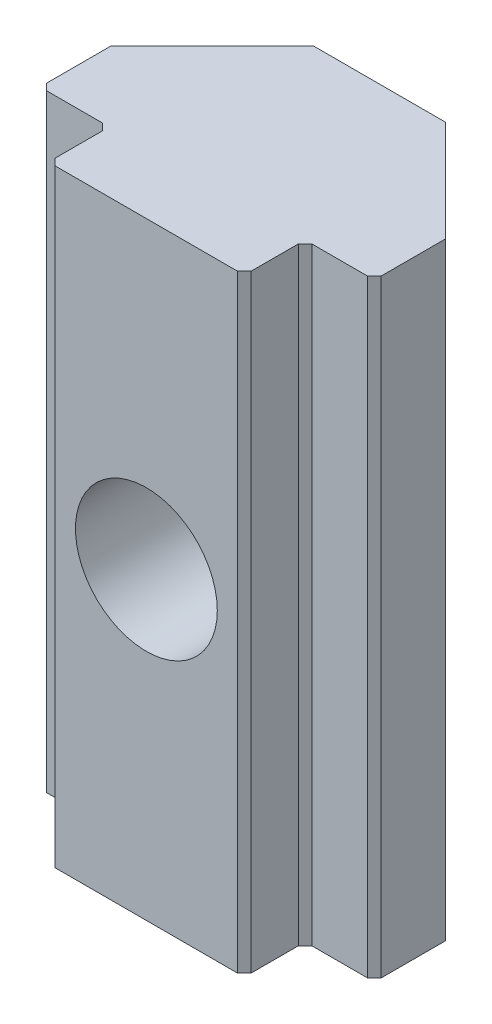
ISO-10303-21;
HEADER;
FILE_DESCRIPTION(('STEP AP214'),'2;1');
FILE_NAME('part.step','',(''),(''),'','','');
FILE_SCHEMA(('AUTOMOTIVE_DESIGN { 1 0 10303 214 1 1 1 1 }'));
ENDSEC;
DATA;
#1=APPLICATION_CONTEXT('core data for automotive mechanical design processes');
#2=APPLICATION_PROTOCOL_DEFINITION('international standard','automotive_design',2000,#1);
#3=PRODUCT_CONTEXT('',#1,'mechanical');
#4=PRODUCT('Part','Part','',(#3));
#5=PRODUCT_RELATED_PRODUCT_CATEGORY('part','',(#4));
#6=PRODUCT_DEFINITION_FORMATION('','',#4);
#7=PRODUCT_DEFINITION_CONTEXT('part definition',#1,'design');
#8=PRODUCT_DEFINITION('design','',#6,#7);
#9=PRODUCT_DEFINITION_SHAPE('','',#8);
#10=(LENGTH_UNIT() NAMED_UNIT(*) SI_UNIT(.MILLI.,.METRE.));
#11=(NAMED_UNIT(*) PLANE_ANGLE_UNIT() SI_UNIT($,.RADIAN.));
#12=(NAMED_UNIT(*) SI_UNIT($,.STERADIAN.) SOLID_ANGLE_UNIT());
#13=UNCERTAINTY_MEASURE_WITH_UNIT(LENGTH_MEASURE(1.E-05),#10,'distance_accuracy_value','');
#14=(GEOMETRIC_REPRESENTATION_CONTEXT(3) GLOBAL_UNCERTAINTY_ASSIGNED_CONTEXT((#13)) GLOBAL_UNIT_ASSIGNED_CONTEXT((#10,
#11,#12)) REPRESENTATION_CONTEXT('',''));
#15=CARTESIAN_POINT('',(0.,0.,0.));
#16=DIRECTION('',(0.,0.,1.));
#17=DIRECTION('',(1.,0.,0.));
#18=AXIS2_PLACEMENT_3D('',#15,#16,#17);
#19=CARTESIAN_POINT('',(-4.95,18.,-2.55));
#20=DIRECTION('',(0.,0.,1.));
#21=DIRECTION('',(1.,0.,0.));
#22=AXIS2_PLACEMENT_3D('',#19,#20,#21);
#23=PLANE('',#22);
#24=DIRECTION('',(0.,-1.,0.));
#25=VECTOR('',#24,1.);
#26=CARTESIAN_POINT('',(1.95,18.,-2.55));
#27=LINE('',#26,#25);
#28=CARTESIAN_POINT('',(1.95,18.,-2.55));
#29=VERTEX_POINT('',#28);
#30=CARTESIAN_POINT('',(1.95,9.77942286340599,-2.55));
#31=VERTEX_POINT('',#30);
#32=EDGE_CURVE('E186',#29,#31,#27,.T.);
#33=ORIENTED_EDGE('',*,*,#32,.T.);
#34=CARTESIAN_POINT('',(0.,9.,-2.55));
#35=DIRECTION('',(0.,0.,1.));
#36=DIRECTION('',(1.,0.,0.));
#37=AXIS2_PLACEMENT_3D('',#34,#35,#36);
#38=CIRCLE('',#37,2.1);
#39=CARTESIAN_POINT('',(-1.94999999999999,9.77942286340602,-2.55));
#40=VERTEX_POINT('',#39);
#41=EDGE_CURVE('E61',#31,#40,#38,.T.);
#42=ORIENTED_EDGE('',*,*,#41,.T.);
#43=DIRECTION('',(0.,1.,0.));
#44=VECTOR('',#43,1.);
#45=CARTESIAN_POINT('',(-1.94999999999999,18.,-2.55));
#46=LINE('',#45,#44);
#47=CARTESIAN_POINT('',(-1.94999999999999,18.,-2.55));
#48=VERTEX_POINT('',#47);
#49=EDGE_CURVE('E183',#40,#48,#46,.T.);
#50=ORIENTED_EDGE('',*,*,#49,.T.);
#51=DIRECTION('',(-1.,0.,0.));
#52=VECTOR('',#51,1.);
#53=CARTESIAN_POINT('',(-4.95,18.,-2.55));
#54=LINE('',#53,#52);
#55=EDGE_CURVE('E398',#29,#48,#54,.T.);
#56=ORIENTED_EDGE('',*,*,#55,.F.);
#57=EDGE_LOOP('',(#33,#42,#50,#56));
#58=FACE_BOUND('',#57,.T.);
#59=ADVANCED_FACE('F45',(#58),#23,.F.);
#60=CARTESIAN_POINT('',(4.95,18.,2.55));
#61=DIRECTION('',(-1.,0.,0.));
#62=DIRECTION('',(0.,0.,1.));
#63=AXIS2_PLACEMENT_3D('',#60,#61,#62);
#64=PLANE('',#63);
#65=DIRECTION('',(0.,0.,-1.));
#66=VECTOR('',#65,1.);
#67=CARTESIAN_POINT('',(4.95,18.,2.55));
#68=LINE('',#67,#66);
#69=CARTESIAN_POINT('',(4.95,18.,2.35));
#70=VERTEX_POINT('',#69);
#71=CARTESIAN_POINT('',(4.95,18.,0.450000000000006));
#72=VERTEX_POINT('',#71);
#73=EDGE_CURVE('E322',#70,#72,#68,.T.);
#74=ORIENTED_EDGE('',*,*,#73,.F.);
#75=DIRECTION('',(0.,-1.,0.));
#76=VECTOR('',#75,1.);
#77=CARTESIAN_POINT('',(4.95,18.,2.35));
#78=LINE('',#77,#76);
#79=CARTESIAN_POINT('',(4.95,0.,2.35));
#80=VERTEX_POINT('',#79);
#81=EDGE_CURVE('E252',#70,#80,#78,.T.);
#82=ORIENTED_EDGE('',*,*,#81,.T.);
#83=DIRECTION('',(0.,0.,-1.));
#84=VECTOR('',#83,1.);
#85=CARTESIAN_POINT('',(4.95,0.,2.55));
#86=LINE('',#85,#84);
#87=CARTESIAN_POINT('',(4.95,0.,0.450000000000006));
#88=VERTEX_POINT('',#87);
#89=EDGE_CURVE('E188',#80,#88,#86,.T.);
#90=ORIENTED_EDGE('',*,*,#89,.T.);
#91=DIRECTION('',(0.,1.,0.));
#92=VECTOR('',#91,1.);
#93=CARTESIAN_POINT('',(4.95,18.,0.450000000000006));
#94=LINE('',#93,#92);
#95=EDGE_CURVE('E208',#88,#72,#94,.T.);
#96=ORIENTED_EDGE('',*,*,#95,.T.);
#97=EDGE_LOOP('',(#74,#82,#90,#96));
#98=FACE_BOUND('',#97,.T.);
#99=ADVANCED_FACE('F419',(#98),#64,.F.);
#100=CARTESIAN_POINT('',(-1.94999999999999,0.,-2.55));
#101=VERTEX_POINT('',#100);
#102=CARTESIAN_POINT('',(-1.94999999999999,8.22057713659398,-2.55));
#103=VERTEX_POINT('',#102);
#104=EDGE_CURVE('E195',#101,#103,#46,.T.);
#105=ORIENTED_EDGE('',*,*,#104,.T.);
#106=CARTESIAN_POINT('',(1.95,8.22057713659401,-2.55));
#107=VERTEX_POINT('',#106);
#108=EDGE_CURVE('E173',#103,#107,#38,.T.);
#109=ORIENTED_EDGE('',*,*,#108,.T.);
#110=CARTESIAN_POINT('',(1.95,0.,-2.55));
#111=VERTEX_POINT('',#110);
#112=EDGE_CURVE('E200',#107,#111,#27,.T.);
#113=ORIENTED_EDGE('',*,*,#112,.T.);
#114=DIRECTION('',(-1.,0.,0.));
#115=VECTOR('',#114,1.);
#116=CARTESIAN_POINT('',(-4.95,0.,-2.55));
#117=LINE('',#116,#115);
#118=EDGE_CURVE('E345',#111,#101,#117,.T.);
#119=ORIENTED_EDGE('',*,*,#118,.T.);
#120=EDGE_LOOP('',(#105,#109,#113,#119));
#121=FACE_BOUND('',#120,.T.);
#122=ADVANCED_FACE('F344',(#121),#23,.F.);
#123=CARTESIAN_POINT('',(-4.95,18.,2.55));
#124=DIRECTION('',(1.,0.,0.));
#125=DIRECTION('',(0.,0.,-1.));
#126=AXIS2_PLACEMENT_3D('',#123,#124,#125);
#127=PLANE('',#126);
#128=DIRECTION('',(0.,0.,1.));
#129=VECTOR('',#128,1.);
#130=CARTESIAN_POINT('',(-4.95,0.,2.55));
#131=LINE('',#130,#129);
#132=CARTESIAN_POINT('',(-4.95,0.,0.45));
#133=VERTEX_POINT('',#132);
#134=CARTESIAN_POINT('',(-4.95,0.,2.34999999999999));
#135=VERTEX_POINT('',#134);
#136=EDGE_CURVE('E352',#133,#135,#131,.T.);
#137=ORIENTED_EDGE('',*,*,#136,.T.);
#138=DIRECTION('',(0.,1.,0.));
#139=VECTOR('',#138,1.);
#140=CARTESIAN_POINT('',(-4.95,18.,2.34999999999999));
#141=LINE('',#140,#139);
#142=CARTESIAN_POINT('',(-4.95,18.,2.34999999999999));
#143=VERTEX_POINT('',#142);
#144=EDGE_CURVE('E238',#135,#143,#141,.T.);
#145=ORIENTED_EDGE('',*,*,#144,.T.);
#146=DIRECTION('',(0.,0.,1.));
#147=VECTOR('',#146,1.);
#148=CARTESIAN_POINT('',(-4.95,18.,2.55));
#149=LINE('',#148,#147);
#150=CARTESIAN_POINT('',(-4.95,18.,0.45));
#151=VERTEX_POINT('',#150);
#152=EDGE_CURVE('E395',#151,#143,#149,.T.);
#153=ORIENTED_EDGE('',*,*,#152,.F.);
#154=DIRECTION('',(0.,-1.,0.));
#155=VECTOR('',#154,1.);
#156=CARTESIAN_POINT('',(-4.95,18.,0.45));
#157=LINE('',#156,#155);
#158=EDGE_CURVE('E304',#151,#133,#157,.T.);
#159=ORIENTED_EDGE('',*,*,#158,.T.);
#160=EDGE_LOOP('',(#137,#145,#153,#159));
#161=FACE_BOUND('',#160,.T.);
#162=ADVANCED_FACE('F428',(#161),#127,.F.);
#163=CARTESIAN_POINT('',(-4.95,18.,2.55));
#164=DIRECTION('',(0.,0.,-1.));
#165=DIRECTION('',(-1.,0.,0.));
#166=AXIS2_PLACEMENT_3D('',#163,#164,#165);
#167=PLANE('',#166);
#168=DIRECTION('',(1.,0.,0.));
#169=VECTOR('',#168,1.);
#170=CARTESIAN_POINT('',(-4.95,0.,2.55));
#171=LINE('',#170,#169);
#172=CARTESIAN_POINT('',(-4.75,0.,2.55));
#173=VERTEX_POINT('',#172);
#174=CARTESIAN_POINT('',(-3.1,0.,2.55));
#175=VERTEX_POINT('',#174);
#176=EDGE_CURVE('E357',#173,#175,#171,.T.);
#177=ORIENTED_EDGE('',*,*,#176,.T.);
#178=DIRECTION('',(0.,1.,0.));
#179=VECTOR('',#178,1.);
#180=CARTESIAN_POINT('',(-3.1,18.,2.55));
#181=LINE('',#180,#179);
#182=CARTESIAN_POINT('',(-3.1,18.,2.55));
#183=VERTEX_POINT('',#182);
#184=EDGE_CURVE('E223',#175,#183,#181,.T.);
#185=ORIENTED_EDGE('',*,*,#184,.T.);
#186=DIRECTION('',(1.,0.,0.));
#187=VECTOR('',#186,1.);
#188=CARTESIAN_POINT('',(-4.95,18.,2.55));
#189=LINE('',#188,#187);
#190=CARTESIAN_POINT('',(-4.75,18.,2.55));
#191=VERTEX_POINT('',#190);
#192=EDGE_CURVE('E389',#191,#183,#189,.T.);
#193=ORIENTED_EDGE('',*,*,#192,.F.);
#194=DIRECTION('',(0.,-1.,0.));
#195=VECTOR('',#194,1.);
#196=CARTESIAN_POINT('',(-4.75,18.,2.55));
#197=LINE('',#196,#195);
#198=EDGE_CURVE('E219',#191,#173,#197,.T.);
#199=ORIENTED_EDGE('',*,*,#198,.T.);
#200=EDGE_LOOP('',(#177,#185,#193,#199));
#201=FACE_BOUND('',#200,.T.);
#202=ADVANCED_FACE('F416',(#201),#167,.F.);
#203=CARTESIAN_POINT('',(-2.9,18.,4.35));
#204=DIRECTION('',(1.,0.,0.));
#205=DIRECTION('',(0.,0.,-1.));
#206=AXIS2_PLACEMENT_3D('',#203,#204,#205);
#207=PLANE('',#206);
#208=DIRECTION('',(0.,0.,1.));
#209=VECTOR('',#208,1.);
#210=CARTESIAN_POINT('',(-2.9,18.,4.35));
#211=LINE('',#210,#209);
#212=CARTESIAN_POINT('',(-2.9,18.,2.75));
#213=VERTEX_POINT('',#212);
#214=CARTESIAN_POINT('',(-2.9,18.,4.15));
#215=VERTEX_POINT('',#214);
#216=EDGE_CURVE('E379',#213,#215,#211,.T.);
#217=ORIENTED_EDGE('',*,*,#216,.F.);
#218=DIRECTION('',(0.,-1.,0.));
#219=VECTOR('',#218,1.);
#220=CARTESIAN_POINT('',(-2.9,0.,2.75));
#221=LINE('',#220,#219);
#222=CARTESIAN_POINT('',(-2.9,0.,2.75));
#223=VERTEX_POINT('',#222);
#224=EDGE_CURVE('E215',#213,#223,#221,.T.);
#225=ORIENTED_EDGE('',*,*,#224,.T.);
#226=DIRECTION('',(0.,0.,1.));
#227=VECTOR('',#226,1.);
#228=CARTESIAN_POINT('',(-2.9,0.,4.35));
#229=LINE('',#228,#227);
#230=CARTESIAN_POINT('',(-2.9,0.,4.15));
#231=VERTEX_POINT('',#230);
#232=EDGE_CURVE('E325',#223,#231,#229,.T.);
#233=ORIENTED_EDGE('',*,*,#232,.T.);
#234=DIRECTION('',(0.,1.,0.));
#235=VECTOR('',#234,1.);
#236=CARTESIAN_POINT('',(-2.9,18.,4.15));
#237=LINE('',#236,#235);
#238=EDGE_CURVE('E212',#231,#215,#237,.T.);
#239=ORIENTED_EDGE('',*,*,#238,.T.);
#240=EDGE_LOOP('',(#217,#225,#233,#239));
#241=FACE_BOUND('',#240,.T.);
#242=ADVANCED_FACE('F369',(#241),#207,.F.);
#243=CARTESIAN_POINT('',(-2.9,18.,4.35));
#244=DIRECTION('',(0.,0.,-1.));
#245=DIRECTION('',(-1.,0.,0.));
#246=AXIS2_PLACEMENT_3D('',#243,#244,#245);
#247=PLANE('',#246);
#248=CARTESIAN_POINT('',(0.,9.,4.35));
#249=DIRECTION('',(0.,0.,1.));
#250=DIRECTION('',(1.,0.,0.));
#251=AXIS2_PLACEMENT_3D('',#248,#249,#250);
#252=CIRCLE('',#251,2.1);
#253=CARTESIAN_POINT('',(2.1,9.,4.35));
#254=VERTEX_POINT('',#253);
#255=EDGE_CURVE('E403',#254,#254,#252,.T.);
#256=ORIENTED_EDGE('',*,*,#255,.F.);
#257=EDGE_LOOP('',(#256));
#258=FACE_BOUND('',#257,.T.);
#259=DIRECTION('',(1.,0.,0.));
#260=VECTOR('',#259,1.);
#261=CARTESIAN_POINT('',(-2.9,0.,4.35));
#262=LINE('',#261,#260);
#263=CARTESIAN_POINT('',(-2.7,0.,4.35));
#264=VERTEX_POINT('',#263);
#265=CARTESIAN_POINT('',(2.7,0.,4.35));
#266=VERTEX_POINT('',#265);
#267=EDGE_CURVE('E318',#264,#266,#262,.T.);
#268=ORIENTED_EDGE('',*,*,#267,.T.);
#269=DIRECTION('',(0.,1.,0.));
#270=VECTOR('',#269,1.);
#271=CARTESIAN_POINT('',(2.7,18.,4.35));
#272=LINE('',#271,#270);
#273=CARTESIAN_POINT('',(2.7,18.,4.35));
#274=VERTEX_POINT('',#273);
#275=EDGE_CURVE('E274',#266,#274,#272,.T.);
#276=ORIENTED_EDGE('',*,*,#275,.T.);
#277=DIRECTION('',(1.,0.,0.));
#278=VECTOR('',#277,1.);
#279=CARTESIAN_POINT('',(-2.9,18.,4.35));
#280=LINE('',#279,#278);
#281=CARTESIAN_POINT('',(-2.7,18.,4.35));
#282=VERTEX_POINT('',#281);
#283=EDGE_CURVE('E377',#282,#274,#280,.T.);
#284=ORIENTED_EDGE('',*,*,#283,.F.);
#285=DIRECTION('',(0.,-1.,0.));
#286=VECTOR('',#285,1.);
#287=CARTESIAN_POINT('',(-2.7,18.,4.35));
#288=LINE('',#287,#286);
#289=EDGE_CURVE('E270',#282,#264,#288,.T.);
#290=ORIENTED_EDGE('',*,*,#289,.T.);
#291=EDGE_LOOP('',(#268,#276,#284,#290));
#292=FACE_BOUND('',#291,.T.);
#293=ADVANCED_FACE('F381',(#258,#292),#247,.F.);
#294=CARTESIAN_POINT('',(2.9,18.,4.35));
#295=DIRECTION('',(-1.,0.,0.));
#296=DIRECTION('',(0.,0.,1.));
#297=AXIS2_PLACEMENT_3D('',#294,#295,#296);
#298=PLANE('',#297);
#299=DIRECTION('',(0.,0.,-1.));
#300=VECTOR('',#299,1.);
#301=CARTESIAN_POINT('',(2.9,0.,4.35));
#302=LINE('',#301,#300);
#303=CARTESIAN_POINT('',(2.9,0.,4.15));
#304=VERTEX_POINT('',#303);
#305=CARTESIAN_POINT('',(2.9,0.,2.75));
#306=VERTEX_POINT('',#305);
#307=EDGE_CURVE('E312',#304,#306,#302,.T.);
#308=ORIENTED_EDGE('',*,*,#307,.T.);
#309=DIRECTION('',(0.,1.,0.));
#310=VECTOR('',#309,1.);
#311=CARTESIAN_POINT('',(2.9,18.,2.75));
#312=LINE('',#311,#310);
#313=CARTESIAN_POINT('',(2.9,18.,2.75));
#314=VERTEX_POINT('',#313);
#315=EDGE_CURVE('E267',#306,#314,#312,.T.);
#316=ORIENTED_EDGE('',*,*,#315,.T.);
#317=DIRECTION('',(0.,0.,-1.));
#318=VECTOR('',#317,1.);
#319=CARTESIAN_POINT('',(2.9,18.,4.35));
#320=LINE('',#319,#318);
#321=CARTESIAN_POINT('',(2.9,18.,4.15));
#322=VERTEX_POINT('',#321);
#323=EDGE_CURVE('E294',#322,#314,#320,.T.);
#324=ORIENTED_EDGE('',*,*,#323,.F.);
#325=DIRECTION('',(0.,-1.,0.));
#326=VECTOR('',#325,1.);
#327=CARTESIAN_POINT('',(2.9,18.,4.15));
#328=LINE('',#327,#326);
#329=EDGE_CURVE('E263',#322,#304,#328,.T.);
#330=ORIENTED_EDGE('',*,*,#329,.T.);
#331=EDGE_LOOP('',(#308,#316,#324,#330));
#332=FACE_BOUND('',#331,.T.);
#333=ADVANCED_FACE('F315',(#332),#298,.F.);
#334=CARTESIAN_POINT('',(2.9,18.,2.55));
#335=DIRECTION('',(0.,0.,-1.));
#336=DIRECTION('',(-1.,0.,0.));
#337=AXIS2_PLACEMENT_3D('',#334,#335,#336);
#338=PLANE('',#337);
#339=DIRECTION('',(1.,0.,0.));
#340=VECTOR('',#339,1.);
#341=CARTESIAN_POINT('',(2.9,0.,2.55));
#342=LINE('',#341,#340);
#343=CARTESIAN_POINT('',(3.1,0.,2.55));
#344=VERTEX_POINT('',#343);
#345=CARTESIAN_POINT('',(4.75,0.,2.55));
#346=VERTEX_POINT('',#345);
#347=EDGE_CURVE('E313',#344,#346,#342,.T.);
#348=ORIENTED_EDGE('',*,*,#347,.T.);
#349=DIRECTION('',(0.,1.,0.));
#350=VECTOR('',#349,1.);
#351=CARTESIAN_POINT('',(4.75,18.,2.55));
#352=LINE('',#351,#350);
#353=CARTESIAN_POINT('',(4.75,18.,2.55));
#354=VERTEX_POINT('',#353);
#355=EDGE_CURVE('E260',#346,#354,#352,.T.);
#356=ORIENTED_EDGE('',*,*,#355,.T.);
#357=DIRECTION('',(1.,0.,0.));
#358=VECTOR('',#357,1.);
#359=CARTESIAN_POINT('',(2.9,18.,2.55));
#360=LINE('',#359,#358);
#361=CARTESIAN_POINT('',(3.1,18.,2.55));
#362=VERTEX_POINT('',#361);
#363=EDGE_CURVE('E292',#362,#354,#360,.T.);
#364=ORIENTED_EDGE('',*,*,#363,.F.);
#365=DIRECTION('',(0.,-1.,0.));
#366=VECTOR('',#365,1.);
#367=CARTESIAN_POINT('',(3.1,0.,2.55));
#368=LINE('',#367,#366);
#369=EDGE_CURVE('E256',#362,#344,#368,.T.);
#370=ORIENTED_EDGE('',*,*,#369,.T.);
#371=EDGE_LOOP('',(#348,#356,#364,#370));
#372=FACE_BOUND('',#371,.T.);
#373=ADVANCED_FACE('F300',(#372),#338,.F.);
#374=CARTESIAN_POINT('',(0.,18.,0.));
#375=DIRECTION('',(0.,-1.,0.));
#376=DIRECTION('',(0.,0.,-1.));
#377=AXIS2_PLACEMENT_3D('',#374,#375,#376);
#378=PLANE('',#377);
#379=ORIENTED_EDGE('',*,*,#152,.T.);
#380=DIRECTION('',(-0.707106781186544,0.,-0.707106781186551));
#381=VECTOR('',#380,1.);
#382=CARTESIAN_POINT('',(-4.75,18.,2.55));
#383=LINE('',#382,#381);
#384=EDGE_CURVE('E249',#143,#191,#383,.F.);
#385=ORIENTED_EDGE('',*,*,#384,.T.);
#386=ORIENTED_EDGE('',*,*,#192,.T.);
#387=DIRECTION('',(-0.707106781186544,0.,-0.707106781186551));
#388=VECTOR('',#387,1.);
#389=CARTESIAN_POINT('',(-2.82500000000001,18.,2.82499999999999));
#390=LINE('',#389,#388);
#391=EDGE_CURVE('E280',#183,#213,#390,.F.);
#392=ORIENTED_EDGE('',*,*,#391,.T.);
#393=ORIENTED_EDGE('',*,*,#216,.T.);
#394=DIRECTION('',(-0.707106781186548,0.,-0.707106781186548));
#395=VECTOR('',#394,1.);
#396=CARTESIAN_POINT('',(-2.7,18.,4.35));
#397=LINE('',#396,#395);
#398=EDGE_CURVE('E241',#215,#282,#397,.F.);
#399=ORIENTED_EDGE('',*,*,#398,.T.);
#400=ORIENTED_EDGE('',*,*,#283,.T.);
#401=DIRECTION('',(-0.707106781186551,0.,0.707106781186544));
#402=VECTOR('',#401,1.);
#403=CARTESIAN_POINT('',(2.9,18.,4.15));
#404=LINE('',#403,#402);
#405=EDGE_CURVE('E244',#274,#322,#404,.F.);
#406=ORIENTED_EDGE('',*,*,#405,.T.);
#407=ORIENTED_EDGE('',*,*,#323,.T.);
#408=DIRECTION('',(-0.707106781186551,0.,0.707106781186544));
#409=VECTOR('',#408,1.);
#410=CARTESIAN_POINT('',(2.82499999999999,18.,2.82500000000001));
#411=LINE('',#410,#409);
#412=EDGE_CURVE('E179',#314,#362,#411,.F.);
#413=ORIENTED_EDGE('',*,*,#412,.T.);
#414=ORIENTED_EDGE('',*,*,#363,.T.);
#415=DIRECTION('',(-0.707106781186548,0.,0.707106781186548));
#416=VECTOR('',#415,1.);
#417=CARTESIAN_POINT('',(4.95,18.,2.35));
#418=LINE('',#417,#416);
#419=EDGE_CURVE('E69',#354,#70,#418,.F.);
#420=ORIENTED_EDGE('',*,*,#419,.T.);
#421=ORIENTED_EDGE('',*,*,#73,.T.);
#422=DIRECTION('',(0.707106781186546,0.,0.707106781186549));
#423=VECTOR('',#422,1.);
#424=CARTESIAN_POINT('',(1.95,18.,-2.55));
#425=LINE('',#424,#423);
#426=EDGE_CURVE('E199',#72,#29,#425,.F.);
#427=ORIENTED_EDGE('',*,*,#426,.T.);
#428=ORIENTED_EDGE('',*,*,#55,.T.);
#429=DIRECTION('',(0.707106781186549,0.,-0.707106781186546));
#430=VECTOR('',#429,1.);
#431=CARTESIAN_POINT('',(-4.95,18.,0.45));
#432=LINE('',#431,#430);
#433=EDGE_CURVE('E193',#48,#151,#432,.F.);
#434=ORIENTED_EDGE('',*,*,#433,.T.);
#435=EDGE_LOOP('',(#379,#385,#386,#392,#393,#399,#400,#406,#407,#413,#414,#420,#421,#427,#428,#434));
#436=FACE_BOUND('',#435,.T.);
#437=ADVANCED_FACE('F291',(#436),#378,.F.);
#438=CARTESIAN_POINT('',(0.,0.,0.));
#439=DIRECTION('',(0.,-1.,0.));
#440=DIRECTION('',(0.,0.,-1.));
#441=AXIS2_PLACEMENT_3D('',#438,#439,#440);
#442=PLANE('',#441);
#443=ORIENTED_EDGE('',*,*,#176,.F.);
#444=DIRECTION('',(0.707106781186544,0.,0.707106781186551));
#445=VECTOR('',#444,1.);
#446=CARTESIAN_POINT('',(-3.65000000000002,0.,3.64999999999999));
#447=LINE('',#446,#445);
#448=EDGE_CURVE('E235',#173,#135,#447,.F.);
#449=ORIENTED_EDGE('',*,*,#448,.T.);
#450=ORIENTED_EDGE('',*,*,#136,.F.);
#451=DIRECTION('',(-0.707106781186549,0.,0.707106781186546));
#452=VECTOR('',#451,1.);
#453=CARTESIAN_POINT('',(-2.24999999999999,0.,-2.25));
#454=LINE('',#453,#452);
#455=EDGE_CURVE('E335',#133,#101,#454,.F.);
#456=ORIENTED_EDGE('',*,*,#455,.T.);
#457=ORIENTED_EDGE('',*,*,#118,.F.);
#458=DIRECTION('',(-0.707106781186546,0.,-0.707106781186549));
#459=VECTOR('',#458,1.);
#460=CARTESIAN_POINT('',(2.25000000000001,0.,-2.25));
#461=LINE('',#460,#459);
#462=EDGE_CURVE('E332',#111,#88,#461,.F.);
#463=ORIENTED_EDGE('',*,*,#462,.T.);
#464=ORIENTED_EDGE('',*,*,#89,.F.);
#465=DIRECTION('',(0.707106781186548,0.,-0.707106781186548));
#466=VECTOR('',#465,1.);
#467=CARTESIAN_POINT('',(3.65,0.,3.65));
#468=LINE('',#467,#466);
#469=EDGE_CURVE('E232',#80,#346,#468,.F.);
#470=ORIENTED_EDGE('',*,*,#469,.T.);
#471=ORIENTED_EDGE('',*,*,#347,.F.);
#472=DIRECTION('',(0.707106781186551,0.,-0.707106781186544));
#473=VECTOR('',#472,1.);
#474=CARTESIAN_POINT('',(3.1,0.,2.55));
#475=LINE('',#474,#473);
#476=EDGE_CURVE('E283',#344,#306,#475,.F.);
#477=ORIENTED_EDGE('',*,*,#476,.T.);
#478=ORIENTED_EDGE('',*,*,#307,.F.);
#479=DIRECTION('',(0.707106781186551,0.,-0.707106781186544));
#480=VECTOR('',#479,1.);
#481=CARTESIAN_POINT('',(3.52499999999999,0.,3.52500000000002));
#482=LINE('',#481,#480);
#483=EDGE_CURVE('E229',#304,#266,#482,.F.);
#484=ORIENTED_EDGE('',*,*,#483,.T.);
#485=ORIENTED_EDGE('',*,*,#267,.F.);
#486=DIRECTION('',(0.707106781186548,0.,0.707106781186548));
#487=VECTOR('',#486,1.);
#488=CARTESIAN_POINT('',(-3.525,0.,3.525));
#489=LINE('',#488,#487);
#490=EDGE_CURVE('E226',#264,#231,#489,.F.);
#491=ORIENTED_EDGE('',*,*,#490,.T.);
#492=ORIENTED_EDGE('',*,*,#232,.F.);
#493=DIRECTION('',(0.707106781186544,0.,0.707106781186551));
#494=VECTOR('',#493,1.);
#495=CARTESIAN_POINT('',(-2.9,0.,2.75));
#496=LINE('',#495,#494);
#497=EDGE_CURVE('E277',#223,#175,#496,.F.);
#498=ORIENTED_EDGE('',*,*,#497,.T.);
#499=EDGE_LOOP('',(#443,#449,#450,#456,#457,#463,#464,#470,#471,#477,#478,#484,#485,#491,#492,#498));
#500=FACE_BOUND('',#499,.T.);
#501=ADVANCED_FACE('F311',(#500),#442,.T.);
#502=CARTESIAN_POINT('',(-4.95,18.,0.45));
#503=DIRECTION('',(0.707106781186546,0.,0.707106781186549));
#504=DIRECTION('',(0.,-1.,0.));
#505=AXIS2_PLACEMENT_3D('',#502,#503,#504);
#506=PLANE('',#505);
#507=CARTESIAN_POINT('',(0.,9.,-4.49999999999998));
#508=DIRECTION('',(0.707106781186546,0.,0.707106781186549));
#509=DIRECTION('',(-0.707106781186549,0.,0.707106781186546));
#510=AXIS2_PLACEMENT_3D('',#507,#508,#509);
#511=ELLIPSE('',#510,2.96984848098349,2.1);
#512=EDGE_CURVE('E55',#103,#40,#511,.F.);
#513=ORIENTED_EDGE('',*,*,#512,.F.);
#514=ORIENTED_EDGE('',*,*,#104,.F.);
#515=ORIENTED_EDGE('',*,*,#455,.F.);
#516=ORIENTED_EDGE('',*,*,#158,.F.);
#517=ORIENTED_EDGE('',*,*,#433,.F.);
#518=ORIENTED_EDGE('',*,*,#49,.F.);
#519=EDGE_LOOP('',(#513,#514,#515,#516,#517,#518));
#520=FACE_BOUND('',#519,.T.);
#521=ADVANCED_FACE('F191',(#520),#506,.F.);
#522=CARTESIAN_POINT('',(1.95,18.,-2.55));
#523=DIRECTION('',(-0.707106781186549,0.,0.707106781186546));
#524=DIRECTION('',(0.,-1.,0.));
#525=AXIS2_PLACEMENT_3D('',#522,#523,#524);
#526=PLANE('',#525);
#527=CARTESIAN_POINT('',(0.,9.,-4.50000000000001));
#528=DIRECTION('',(-0.707106781186549,0.,0.707106781186546));
#529=DIRECTION('',(0.707106781186546,0.,0.707106781186549));
#530=AXIS2_PLACEMENT_3D('',#527,#528,#529);
#531=ELLIPSE('',#530,2.9698484809835,2.1);
#532=EDGE_CURVE('E11',#31,#107,#531,.F.);
#533=ORIENTED_EDGE('',*,*,#532,.F.);
#534=ORIENTED_EDGE('',*,*,#32,.F.);
#535=ORIENTED_EDGE('',*,*,#426,.F.);
#536=ORIENTED_EDGE('',*,*,#95,.F.);
#537=ORIENTED_EDGE('',*,*,#462,.F.);
#538=ORIENTED_EDGE('',*,*,#112,.F.);
#539=EDGE_LOOP('',(#533,#534,#535,#536,#537,#538));
#540=FACE_BOUND('',#539,.T.);
#541=ADVANCED_FACE('F348',(#540),#526,.F.);
#542=CARTESIAN_POINT('',(-2.9,18.,2.75));
#543=DIRECTION('',(-0.707106781186551,0.,0.707106781186544));
#544=DIRECTION('',(0.,1.,0.));
#545=AXIS2_PLACEMENT_3D('',#542,#543,#544);
#546=PLANE('',#545);
#547=ORIENTED_EDGE('',*,*,#391,.F.);
#548=ORIENTED_EDGE('',*,*,#184,.F.);
#549=ORIENTED_EDGE('',*,*,#497,.F.);
#550=ORIENTED_EDGE('',*,*,#224,.F.);
#551=EDGE_LOOP('',(#547,#548,#549,#550));
#552=FACE_BOUND('',#551,.T.);
#553=ADVANCED_FACE('F448',(#552),#546,.T.);
#554=CARTESIAN_POINT('',(-4.75,18.,2.55));
#555=DIRECTION('',(0.707106781186551,0.,-0.707106781186544));
#556=DIRECTION('',(0.,-1.,0.));
#557=AXIS2_PLACEMENT_3D('',#554,#555,#556);
#558=PLANE('',#557);
#559=ORIENTED_EDGE('',*,*,#384,.F.);
#560=ORIENTED_EDGE('',*,*,#144,.F.);
#561=ORIENTED_EDGE('',*,*,#448,.F.);
#562=ORIENTED_EDGE('',*,*,#198,.F.);
#563=EDGE_LOOP('',(#559,#560,#561,#562));
#564=FACE_BOUND('',#563,.T.);
#565=ADVANCED_FACE('F442',(#564),#558,.F.);
#566=CARTESIAN_POINT('',(4.95,18.,2.35));
#567=DIRECTION('',(-0.707106781186547,0.,-0.707106781186547));
#568=DIRECTION('',(0.,-1.,0.));
#569=AXIS2_PLACEMENT_3D('',#566,#567,#568);
#570=PLANE('',#569);
#571=ORIENTED_EDGE('',*,*,#419,.F.);
#572=ORIENTED_EDGE('',*,*,#355,.F.);
#573=ORIENTED_EDGE('',*,*,#469,.F.);
#574=ORIENTED_EDGE('',*,*,#81,.F.);
#575=EDGE_LOOP('',(#571,#572,#573,#574));
#576=FACE_BOUND('',#575,.T.);
#577=ADVANCED_FACE('F455',(#576),#570,.F.);
#578=CARTESIAN_POINT('',(3.1,18.,2.55));
#579=DIRECTION('',(0.707106781186544,0.,0.707106781186551));
#580=DIRECTION('',(0.,1.,0.));
#581=AXIS2_PLACEMENT_3D('',#578,#579,#580);
#582=PLANE('',#581);
#583=ORIENTED_EDGE('',*,*,#412,.F.);
#584=ORIENTED_EDGE('',*,*,#315,.F.);
#585=ORIENTED_EDGE('',*,*,#476,.F.);
#586=ORIENTED_EDGE('',*,*,#369,.F.);
#587=EDGE_LOOP('',(#583,#584,#585,#586));
#588=FACE_BOUND('',#587,.T.);
#589=ADVANCED_FACE('F306',(#588),#582,.T.);
#590=CARTESIAN_POINT('',(2.9,18.,4.15));
#591=DIRECTION('',(-0.707106781186544,0.,-0.707106781186551));
#592=DIRECTION('',(0.,-1.,0.));
#593=AXIS2_PLACEMENT_3D('',#590,#591,#592);
#594=PLANE('',#593);
#595=ORIENTED_EDGE('',*,*,#405,.F.);
#596=ORIENTED_EDGE('',*,*,#275,.F.);
#597=ORIENTED_EDGE('',*,*,#483,.F.);
#598=ORIENTED_EDGE('',*,*,#329,.F.);
#599=EDGE_LOOP('',(#595,#596,#597,#598));
#600=FACE_BOUND('',#599,.T.);
#601=ADVANCED_FACE('F478',(#600),#594,.F.);
#602=CARTESIAN_POINT('',(-2.7,18.,4.35));
#603=DIRECTION('',(0.707106781186547,0.,-0.707106781186547));
#604=DIRECTION('',(0.,-1.,0.));
#605=AXIS2_PLACEMENT_3D('',#602,#603,#604);
#606=PLANE('',#605);
#607=ORIENTED_EDGE('',*,*,#398,.F.);
#608=ORIENTED_EDGE('',*,*,#238,.F.);
#609=ORIENTED_EDGE('',*,*,#490,.F.);
#610=ORIENTED_EDGE('',*,*,#289,.F.);
#611=EDGE_LOOP('',(#607,#608,#609,#610));
#612=FACE_BOUND('',#611,.T.);
#613=ADVANCED_FACE('F48',(#612),#606,.F.);
#614=CARTESIAN_POINT('',(0.,9.,4.35));
#615=DIRECTION('',(0.,0.,1.));
#616=DIRECTION('',(1.,0.,0.));
#617=AXIS2_PLACEMENT_3D('',#614,#615,#616);
#618=CYLINDRICAL_SURFACE('',#617,2.1);
#619=ORIENTED_EDGE('',*,*,#512,.T.);
#620=ORIENTED_EDGE('',*,*,#41,.F.);
#621=ORIENTED_EDGE('',*,*,#532,.T.);
#622=ORIENTED_EDGE('',*,*,#108,.F.);
#623=EDGE_LOOP('',(#619,#620,#621,#622));
#624=FACE_BOUND('',#623,.T.);
#625=ORIENTED_EDGE('',*,*,#255,.T.);
#626=EDGE_LOOP('',(#625));
#627=FACE_BOUND('',#626,.T.);
#628=ADVANCED_FACE('F170',(#624,#627),#618,.F.);
#629=CLOSED_SHELL('',(#59,#99,#122,#162,#202,#242,#293,#333,#373,#437,#501,#521,#541,#553,#565,
#577,#589,#601,#613,#628));
#630=MANIFOLD_SOLID_BREP('B2',#629);
#631=ADVANCED_BREP_SHAPE_REPRESENTATION('',(#18,#630),#14);
#632=SHAPE_DEFINITION_REPRESENTATION(#9,#631);
ENDSEC;
END-ISO-10303-21;
